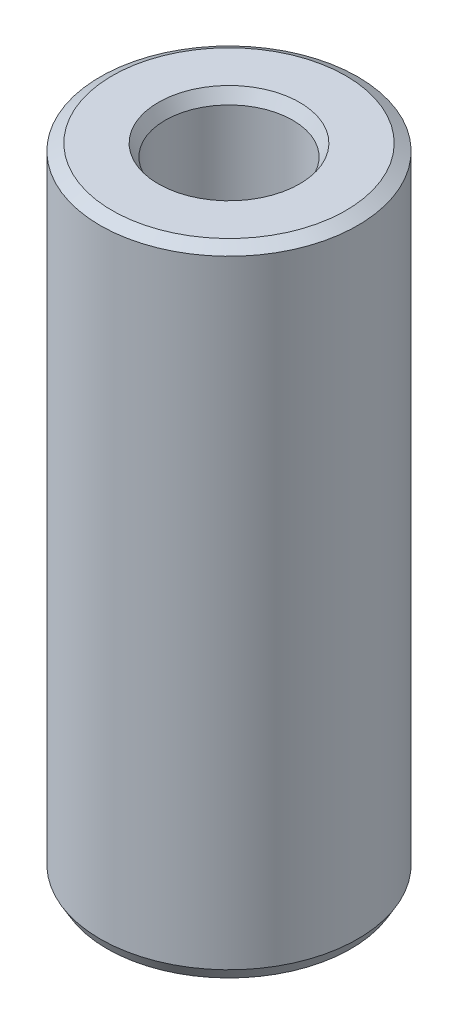
ISO-10303-21;
HEADER;
FILE_DESCRIPTION(('STEP AP214'),'2;1');
FILE_NAME('part.step','',(''),(''),'','','');
FILE_SCHEMA(('AUTOMOTIVE_DESIGN { 1 0 10303 214 1 1 1 1 }'));
ENDSEC;
DATA;
#1=APPLICATION_CONTEXT('core data for automotive mechanical design processes');
#2=APPLICATION_PROTOCOL_DEFINITION('international standard','automotive_design',2000,#1);
#3=PRODUCT_CONTEXT('',#1,'mechanical');
#4=PRODUCT('Part','Part','',(#3));
#5=PRODUCT_RELATED_PRODUCT_CATEGORY('part','',(#4));
#6=PRODUCT_DEFINITION_FORMATION('','',#4);
#7=PRODUCT_DEFINITION_CONTEXT('part definition',#1,'design');
#8=PRODUCT_DEFINITION('design','',#6,#7);
#9=PRODUCT_DEFINITION_SHAPE('','',#8);
#10=(LENGTH_UNIT() NAMED_UNIT(*) SI_UNIT(.MILLI.,.METRE.));
#11=(NAMED_UNIT(*) PLANE_ANGLE_UNIT() SI_UNIT($,.RADIAN.));
#12=(NAMED_UNIT(*) SI_UNIT($,.STERADIAN.) SOLID_ANGLE_UNIT());
#13=UNCERTAINTY_MEASURE_WITH_UNIT(LENGTH_MEASURE(1.E-05),#10,'distance_accuracy_value','');
#14=(GEOMETRIC_REPRESENTATION_CONTEXT(3) GLOBAL_UNCERTAINTY_ASSIGNED_CONTEXT((#13)) GLOBAL_UNIT_ASSIGNED_CONTEXT((#10,
#11,#12)) REPRESENTATION_CONTEXT('',''));
#15=CARTESIAN_POINT('',(0.,0.,0.));
#16=DIRECTION('',(0.,0.,1.));
#17=DIRECTION('',(1.,0.,0.));
#18=AXIS2_PLACEMENT_3D('',#15,#16,#17);
#19=CARTESIAN_POINT('',(0.,135.97263248255,0.));
#20=DIRECTION('',(0.,-1.,0.));
#21=DIRECTION('',(0.,0.,-1.));
#22=AXIS2_PLACEMENT_3D('',#19,#20,#21);
#23=CYLINDRICAL_SURFACE('',#22,27.5);
#24=CARTESIAN_POINT('',(0.,2.55862509389967,0.));
#25=DIRECTION('',(0.,1.,0.));
#26=DIRECTION('',(0.,0.,1.));
#27=AXIS2_PLACEMENT_3D('',#24,#25,#26);
#28=CIRCLE('',#27,27.5);
#29=CARTESIAN_POINT('',(0.,2.55862509389967,27.5));
#30=VERTEX_POINT('',#29);
#31=EDGE_CURVE('E10',#30,#30,#28,.T.);
#32=ORIENTED_EDGE('',*,*,#31,.T.);
#33=EDGE_LOOP('',(#32));
#34=FACE_BOUND('',#33,.T.);
#35=CARTESIAN_POINT('',(0.,134.495409595831,0.));
#36=DIRECTION('',(0.,1.,0.));
#37=DIRECTION('',(0.,0.,1.));
#38=AXIS2_PLACEMENT_3D('',#35,#36,#37);
#39=CIRCLE('',#38,27.5);
#40=CARTESIAN_POINT('',(0.,134.495409595831,-27.5));
#41=VERTEX_POINT('',#40);
#42=EDGE_CURVE('E50',#41,#41,#39,.F.);
#43=ORIENTED_EDGE('',*,*,#42,.T.);
#44=EDGE_LOOP('',(#43));
#45=FACE_BOUND('',#44,.T.);
#46=ADVANCED_FACE('F39',(#34,#45),#23,.T.);
#47=CARTESIAN_POINT('',(0.,135.97263248255,0.));
#48=DIRECTION('',(0.,1.,0.));
#49=DIRECTION('',(0.,0.,1.));
#50=AXIS2_PLACEMENT_3D('',#47,#48,#49);
#51=PLANE('',#50);
#52=CARTESIAN_POINT('',(0.,135.97263248255,0.));
#53=DIRECTION('',(0.,1.,0.));
#54=DIRECTION('',(0.,0.,1.));
#55=AXIS2_PLACEMENT_3D('',#52,#53,#54);
#56=CIRCLE('',#55,15.0886060440407);
#57=CARTESIAN_POINT('',(0.,135.97263248255,15.0886060440407));
#58=VERTEX_POINT('',#57);
#59=EDGE_CURVE('E58',#58,#58,#56,.F.);
#60=ORIENTED_EDGE('',*,*,#59,.T.);
#61=EDGE_LOOP('',(#60));
#62=FACE_BOUND('',#61,.T.);
#63=CARTESIAN_POINT('',(0.,135.97263248255,0.));
#64=DIRECTION('',(0.,1.,0.));
#65=DIRECTION('',(0.,0.,1.));
#66=AXIS2_PLACEMENT_3D('',#63,#64,#65);
#67=CIRCLE('',#66,24.9413749061004);
#68=CARTESIAN_POINT('',(0.,135.97263248255,-24.9413749061004));
#69=VERTEX_POINT('',#68);
#70=EDGE_CURVE('E61',#69,#69,#67,.T.);
#71=ORIENTED_EDGE('',*,*,#70,.T.);
#72=EDGE_LOOP('',(#71));
#73=FACE_BOUND('',#72,.T.);
#74=ADVANCED_FACE('F88',(#62,#73),#51,.T.);
#75=CARTESIAN_POINT('',(0.,0.,0.));
#76=DIRECTION('',(0.,1.,0.));
#77=DIRECTION('',(0.,0.,1.));
#78=AXIS2_PLACEMENT_3D('',#75,#76,#77);
#79=PLANE('',#78);
#80=CARTESIAN_POINT('',(0.,0.,0.));
#81=DIRECTION('',(0.,1.,0.));
#82=DIRECTION('',(0.,0.,1.));
#83=AXIS2_PLACEMENT_3D('',#80,#81,#82);
#84=CIRCLE('',#83,16.170008251222);
#85=CARTESIAN_POINT('',(0.,0.,-16.170008251222));
#86=VERTEX_POINT('',#85);
#87=EDGE_CURVE('E51',#86,#86,#84,.T.);
#88=ORIENTED_EDGE('',*,*,#87,.T.);
#89=EDGE_LOOP('',(#88));
#90=FACE_BOUND('',#89,.T.);
#91=CARTESIAN_POINT('',(0.,0.,0.));
#92=DIRECTION('',(0.,1.,0.));
#93=DIRECTION('',(0.,0.,1.));
#94=AXIS2_PLACEMENT_3D('',#91,#92,#93);
#95=CIRCLE('',#94,26.0227771132817);
#96=CARTESIAN_POINT('',(0.,0.,26.0227771132817));
#97=VERTEX_POINT('',#96);
#98=EDGE_CURVE('E54',#97,#97,#95,.F.);
#99=ORIENTED_EDGE('',*,*,#98,.T.);
#100=EDGE_LOOP('',(#99));
#101=FACE_BOUND('',#100,.T.);
#102=ADVANCED_FACE('F83',(#90,#101),#79,.F.);
#103=CARTESIAN_POINT('',(0.,135.97263248255,0.));
#104=DIRECTION('',(0.,-1.,0.));
#105=DIRECTION('',(0.,0.,-1.));
#106=AXIS2_PLACEMENT_3D('',#103,#104,#105);
#107=CYLINDRICAL_SURFACE('',#106,13.6113831573224);
#108=CARTESIAN_POINT('',(0.,133.41400738865,0.));
#109=DIRECTION('',(0.,1.,0.));
#110=DIRECTION('',(0.,0.,1.));
#111=AXIS2_PLACEMENT_3D('',#108,#109,#110);
#112=CIRCLE('',#111,13.6113831573224);
#113=CARTESIAN_POINT('',(0.,133.41400738865,13.6113831573224));
#114=VERTEX_POINT('',#113);
#115=EDGE_CURVE('E67',#114,#114,#112,.T.);
#116=ORIENTED_EDGE('',*,*,#115,.T.);
#117=EDGE_LOOP('',(#116));
#118=FACE_BOUND('',#117,.T.);
#119=CARTESIAN_POINT('',(0.,1.47722288671828,0.));
#120=DIRECTION('',(0.,1.,0.));
#121=DIRECTION('',(0.,0.,1.));
#122=AXIS2_PLACEMENT_3D('',#119,#120,#121);
#123=CIRCLE('',#122,13.6113831573224);
#124=CARTESIAN_POINT('',(0.,1.47722288671828,-13.6113831573224));
#125=VERTEX_POINT('',#124);
#126=EDGE_CURVE('E69',#125,#125,#123,.F.);
#127=ORIENTED_EDGE('',*,*,#126,.T.);
#128=EDGE_LOOP('',(#127));
#129=FACE_BOUND('',#128,.T.);
#130=ADVANCED_FACE('F71',(#118,#129),#107,.F.);
#131=CARTESIAN_POINT('',(0.,133.41400738865,0.));
#132=DIRECTION('',(0.,1.,0.));
#133=DIRECTION('',(0.,0.,1.));
#134=AXIS2_PLACEMENT_3D('',#131,#132,#133);
#135=CONICAL_SURFACE('',#134,13.6113831573224,0.523598775598301);
#136=ORIENTED_EDGE('',*,*,#59,.F.);
#137=EDGE_LOOP('',(#136));
#138=FACE_BOUND('',#137,.T.);
#139=ORIENTED_EDGE('',*,*,#115,.F.);
#140=EDGE_LOOP('',(#139));
#141=FACE_BOUND('',#140,.T.);
#142=ADVANCED_FACE('F77',(#138,#141),#135,.F.);
#143=CARTESIAN_POINT('',(0.,0.,0.));
#144=DIRECTION('',(0.,-1.,0.));
#145=DIRECTION('',(0.,0.,-1.));
#146=AXIS2_PLACEMENT_3D('',#143,#144,#145);
#147=CONICAL_SURFACE('',#146,16.170008251222,1.04719755119659);
#148=CARTESIAN_POINT('',(0.,1.47722288671828,-13.6113831573224));
#149=CARTESIAN_POINT('',(0.,1.46183514831497,-13.6380355020505));
#150=CARTESIAN_POINT('',(0.,1.44644740991165,-13.6646878467787));
#151=CARTESIAN_POINT('',(0.,1.41567193310502,-13.7179925362349));
#152=CARTESIAN_POINT('',(0.,1.4002841947017,-13.744644880963));
#153=CARTESIAN_POINT('',(0.,1.36950871789507,-13.7979495704193));
#154=CARTESIAN_POINT('',(0.,1.35412097949176,-13.8246019151474));
#155=CARTESIAN_POINT('',(0.,1.32334550268513,-13.8779066046036));
#156=CARTESIAN_POINT('',(0.,1.30795776428181,-13.9045589493318));
#157=CARTESIAN_POINT('',(0.,1.27718228747518,-13.957863638788));
#158=CARTESIAN_POINT('',(0.,1.26179454907187,-13.9845159835161));
#159=CARTESIAN_POINT('',(0.,1.23101907226524,-14.0378206729724));
#160=CARTESIAN_POINT('',(0.,1.21563133386192,-14.0644730177005));
#161=CARTESIAN_POINT('',(0.,1.18485585705529,-14.1177777071567));
#162=CARTESIAN_POINT('',(0.,1.16946811865197,-14.1444300518848));
#163=CARTESIAN_POINT('',(0.,1.13869264184534,-14.1977347413411));
#164=CARTESIAN_POINT('',(0.,1.12330490344203,-14.2243870860692));
#165=CARTESIAN_POINT('',(0.,1.0925294266354,-14.2776917755254));
#166=CARTESIAN_POINT('',(0.,1.07714168823208,-14.3043441202536));
#167=CARTESIAN_POINT('',(0.,1.04636621142545,-14.3576488097098));
#168=CARTESIAN_POINT('',(0.,1.03097847302213,-14.3843011544379));
#169=CARTESIAN_POINT('',(0.,1.0002029962155,-14.4376058438942));
#170=CARTESIAN_POINT('',(0.,0.984815257812188,-14.4642581886223));
#171=CARTESIAN_POINT('',(0.,0.954039781005558,-14.5175628780785));
#172=CARTESIAN_POINT('',(0.,0.938652042602242,-14.5442152228067));
#173=CARTESIAN_POINT('',(0.,0.907876565795611,-14.5975199122629));
#174=CARTESIAN_POINT('',(0.,0.892488827392295,-14.624172256991));
#175=CARTESIAN_POINT('',(0.,0.861713350585665,-14.6774769464473));
#176=CARTESIAN_POINT('',(0.,0.846325612182349,-14.7041292911754));
#177=CARTESIAN_POINT('',(0.,0.815550135375718,-14.7574339806316));
#178=CARTESIAN_POINT('',(0.,0.800162396972403,-14.7840863253597));
#179=CARTESIAN_POINT('',(0.,0.769386920165772,-14.837391014816));
#180=CARTESIAN_POINT('',(0.,0.753999181762457,-14.8640433595441));
#181=CARTESIAN_POINT('',(0.,0.723223704955826,-14.9173480490003));
#182=CARTESIAN_POINT('',(0.,0.70783596655251,-14.9440003937285));
#183=CARTESIAN_POINT('',(0.,0.677060489745879,-14.9973050831847));
#184=CARTESIAN_POINT('',(0.,0.661672751342564,-15.0239574279128));
#185=CARTESIAN_POINT('',(0.,0.630897274535933,-15.0772621173691));
#186=CARTESIAN_POINT('',(0.,0.615509536132618,-15.1039144620972));
#187=CARTESIAN_POINT('',(0.,0.584734059325987,-15.1572191515534));
#188=CARTESIAN_POINT('',(0.,0.569346320922671,-15.1838714962816));
#189=CARTESIAN_POINT('',(0.,0.53857084411604,-15.2371761857378));
#190=CARTESIAN_POINT('',(0.,0.523183105712725,-15.2638285304659));
#191=CARTESIAN_POINT('',(0.,0.492407628906094,-15.3171332199222));
#192=CARTESIAN_POINT('',(0.,0.477019890502779,-15.3437855646503));
#193=CARTESIAN_POINT('',(0.,0.446244413696148,-15.3970902541065));
#194=CARTESIAN_POINT('',(0.,0.430856675292832,-15.4237425988346));
#195=CARTESIAN_POINT('',(0.,0.400081198486201,-15.4770472882909));
#196=CARTESIAN_POINT('',(0.,0.384693460082886,-15.503699633019));
#197=CARTESIAN_POINT('',(0.,0.353917983276255,-15.5570043224752));
#198=CARTESIAN_POINT('',(0.,0.33853024487294,-15.5836566672034));
#199=CARTESIAN_POINT('',(0.,0.307754768066309,-15.6369613566596));
#200=CARTESIAN_POINT('',(0.,0.292367029662993,-15.6636137013877));
#201=CARTESIAN_POINT('',(0.,0.261591552856362,-15.716918390844));
#202=CARTESIAN_POINT('',(0.,0.246203814453047,-15.7435707355721));
#203=CARTESIAN_POINT('',(0.,0.215428337646416,-15.7968754250283));
#204=CARTESIAN_POINT('',(0.,0.200040599243101,-15.8235277697565));
#205=CARTESIAN_POINT('',(0.,0.16926512243647,-15.8768324592127));
#206=CARTESIAN_POINT('',(0.,0.153877384033154,-15.9034848039408));
#207=CARTESIAN_POINT('',(0.,0.123101907226523,-15.9567894933971));
#208=CARTESIAN_POINT('',(0.,0.107714168823208,-15.9834418381252));
#209=CARTESIAN_POINT('',(0.,0.0769386920165772,-16.0367465275814));
#210=CARTESIAN_POINT('',(0.,0.0615509536132618,-16.0633988723095));
#211=CARTESIAN_POINT('',(0.,0.0307754768066309,-16.1167035617658));
#212=CARTESIAN_POINT('',(0.,0.0153877384033154,-16.1433559064939));
#213=CARTESIAN_POINT('',(0.,0.,-16.170008251222));
#214=B_SPLINE_CURVE_WITH_KNOTS('',3,(#148,#149,#150,#151,#152,#153,#154,#155,#156,#157,#158,
#159,#160,#161,#162,#163,#164,#165,#166,#167,#168,#169,#170,#171,#172,#173,#174,#175,#176,#177,
#178,#179,#180,#181,#182,#183,#184,#185,#186,#187,#188,#189,#190,#191,#192,#193,#194,#195,#196,
#197,#198,#199,#200,#201,#202,#203,#204,#205,#206,#207,#208,#209,#210,#211,#212,#213),
.UNSPECIFIED.,.F.,.F.,(4,2,2,2,2,2,2,2,2,2,2,2,2,2,2,2,2,2,2,2,2,2,2,2,2,2,2,2,2,2,2,2,4),(0.,
0.0923264304198916,0.184652860839783,0.276979291259676,0.369305721679568,0.46163215209946,
0.553958582519353,0.646285012939245,0.738611443359136,0.830937873779028,0.92326430419892,
1.01559073461881,1.1079171650387,1.2002435954586,1.29257002587849,1.38489645629838,
1.47722288671827,1.56954931713816,1.66187574755806,1.75420217797795,1.84652860839784,
1.93885503881773,2.03118146923762,2.12350789965752,2.21583433007741,2.3081607604973,
2.40048719091719,2.49281362133708,2.58514005175698,2.67746648217687,2.76979291259676,
2.86211934301665,2.95444577343655),.UNSPECIFIED.);
#215=EDGE_CURVE('BSEAM73',#125,#86,#214,.T.);
#216=ORIENTED_EDGE('',*,*,#126,.F.);
#217=ORIENTED_EDGE('',*,*,#87,.F.);
#218=ORIENTED_EDGE('',*,*,#215,.T.);
#219=ORIENTED_EDGE('',*,*,#215,.F.);
#220=EDGE_LOOP('',(#216,#218,#217,#219));
#221=FACE_BOUND('',#220,.T.);
#222=ADVANCED_FACE('F73',(#221),#147,.F.);
#223=CARTESIAN_POINT('',(0.,2.55862509389967,0.));
#224=DIRECTION('',(0.,1.,0.));
#225=DIRECTION('',(0.,0.,1.));
#226=AXIS2_PLACEMENT_3D('',#223,#224,#225);
#227=CONICAL_SURFACE('',#226,27.5,0.523598775598302);
#228=ORIENTED_EDGE('',*,*,#98,.F.);
#229=EDGE_LOOP('',(#228));
#230=FACE_BOUND('',#229,.T.);
#231=ORIENTED_EDGE('',*,*,#31,.F.);
#232=EDGE_LOOP('',(#231));
#233=FACE_BOUND('',#232,.T.);
#234=ADVANCED_FACE('F76',(#230,#233),#227,.T.);
#235=CARTESIAN_POINT('',(0.,135.97263248255,0.));
#236=DIRECTION('',(0.,-1.,0.));
#237=DIRECTION('',(0.,0.,-1.));
#238=AXIS2_PLACEMENT_3D('',#235,#236,#237);
#239=CONICAL_SURFACE('',#238,24.9413749061004,1.0471975511966);
#240=CARTESIAN_POINT('',(0.,134.495409595831,-27.5));
#241=CARTESIAN_POINT('',(0.,134.510797334235,-27.4733476552719));
#242=CARTESIAN_POINT('',(0.,134.526185072638,-27.4466953105438));
#243=CARTESIAN_POINT('',(0.,134.556960549445,-27.3933906210875));
#244=CARTESIAN_POINT('',(0.,134.572348287848,-27.3667382763594));
#245=CARTESIAN_POINT('',(0.,134.603123764655,-27.3134335869032));
#246=CARTESIAN_POINT('',(0.,134.618511503058,-27.2867812421751));
#247=CARTESIAN_POINT('',(0.,134.649286979865,-27.2334765527188));
#248=CARTESIAN_POINT('',(0.,134.664674718268,-27.2068242079907));
#249=CARTESIAN_POINT('',(0.,134.695450195074,-27.1535195185344));
#250=CARTESIAN_POINT('',(0.,134.710837933478,-27.1268671738063));
#251=CARTESIAN_POINT('',(0.,134.741613410284,-27.0735624843501));
#252=CARTESIAN_POINT('',(0.,134.757001148688,-27.046910139622));
#253=CARTESIAN_POINT('',(0.,134.787776625494,-26.9936054501657));
#254=CARTESIAN_POINT('',(0.,134.803164363898,-26.9669531054376));
#255=CARTESIAN_POINT('',(0.,134.833939840704,-26.9136484159814));
#256=CARTESIAN_POINT('',(0.,134.849327579108,-26.8869960712532));
#257=CARTESIAN_POINT('',(0.,134.880103055914,-26.833691381797));
#258=CARTESIAN_POINT('',(0.,134.895490794318,-26.8070390370689));
#259=CARTESIAN_POINT('',(0.,134.926266271124,-26.7537343476126));
#260=CARTESIAN_POINT('',(0.,134.941654009528,-26.7270820028845));
#261=CARTESIAN_POINT('',(0.,134.972429486334,-26.6737773134283));
#262=CARTESIAN_POINT('',(0.,134.987817224737,-26.6471249687001));
#263=CARTESIAN_POINT('',(0.,135.018592701544,-26.5938202792439));
#264=CARTESIAN_POINT('',(0.,135.033980439947,-26.5671679345158));
#265=CARTESIAN_POINT('',(0.,135.064755916754,-26.5138632450595));
#266=CARTESIAN_POINT('',(0.,135.080143655157,-26.4872109003314));
#267=CARTESIAN_POINT('',(0.,135.110919131964,-26.4339062108752));
#268=CARTESIAN_POINT('',(0.,135.126306870367,-26.407253866147));
#269=CARTESIAN_POINT('',(0.,135.157082347174,-26.3539491766908));
#270=CARTESIAN_POINT('',(0.,135.172470085577,-26.3272968319627));
#271=CARTESIAN_POINT('',(0.,135.203245562384,-26.2739921425064));
#272=CARTESIAN_POINT('',(0.,135.218633300787,-26.2473397977783));
#273=CARTESIAN_POINT('',(0.,135.249408777594,-26.1940351083221));
#274=CARTESIAN_POINT('',(0.,135.264796515997,-26.167382763594));
#275=CARTESIAN_POINT('',(0.,135.295571992804,-26.1140780741377));
#276=CARTESIAN_POINT('',(0.,135.310959731207,-26.0874257294096));
#277=CARTESIAN_POINT('',(0.,135.341735208014,-26.0341210399534));
#278=CARTESIAN_POINT('',(0.,135.357122946417,-26.0074686952252));
#279=CARTESIAN_POINT('',(0.,135.387898423224,-25.954164005769));
#280=CARTESIAN_POINT('',(0.,135.403286161627,-25.9275116610409));
#281=CARTESIAN_POINT('',(0.,135.434061638434,-25.8742069715846));
#282=CARTESIAN_POINT('',(0.,135.449449376837,-25.8475546268565));
#283=CARTESIAN_POINT('',(0.,135.480224853644,-25.7942499374003));
#284=CARTESIAN_POINT('',(0.,135.495612592047,-25.7675975926721));
#285=CARTESIAN_POINT('',(0.,135.526388068854,-25.7142929032159));
#286=CARTESIAN_POINT('',(0.,135.541775807257,-25.6876405584878));
#287=CARTESIAN_POINT('',(0.,135.572551284063,-25.6343358690315));
#288=CARTESIAN_POINT('',(0.,135.587939022467,-25.6076835243034));
#289=CARTESIAN_POINT('',(0.,135.618714499273,-25.5543788348472));
#290=CARTESIAN_POINT('',(0.,135.634102237677,-25.527726490119));
#291=CARTESIAN_POINT('',(0.,135.664877714483,-25.4744218006628));
#292=CARTESIAN_POINT('',(0.,135.680265452887,-25.4477694559347));
#293=CARTESIAN_POINT('',(0.,135.711040929693,-25.3944647664784));
#294=CARTESIAN_POINT('',(0.,135.726428668097,-25.3678124217503));
#295=CARTESIAN_POINT('',(0.,135.757204144903,-25.3145077322941));
#296=CARTESIAN_POINT('',(0.,135.772591883307,-25.287855387566));
#297=CARTESIAN_POINT('',(0.,135.803367360113,-25.2345506981097));
#298=CARTESIAN_POINT('',(0.,135.818755098517,-25.2078983533816));
#299=CARTESIAN_POINT('',(0.,135.849530575323,-25.1545936639253));
#300=CARTESIAN_POINT('',(0.,135.864918313726,-25.1279413191972));
#301=CARTESIAN_POINT('',(0.,135.895693790533,-25.074636629741));
#302=CARTESIAN_POINT('',(0.,135.911081528936,-25.0479842850129));
#303=CARTESIAN_POINT('',(0.,135.941857005743,-24.9946795955566));
#304=CARTESIAN_POINT('',(0.,135.957244744146,-24.9680272508285));
#305=CARTESIAN_POINT('',(0.,135.97263248255,-24.9413749061004));
#306=B_SPLINE_CURVE_WITH_KNOTS('',3,(#240,#241,#242,#243,#244,#245,#246,#247,#248,#249,#250,
#251,#252,#253,#254,#255,#256,#257,#258,#259,#260,#261,#262,#263,#264,#265,#266,#267,#268,#269,
#270,#271,#272,#273,#274,#275,#276,#277,#278,#279,#280,#281,#282,#283,#284,#285,#286,#287,#288,
#289,#290,#291,#292,#293,#294,#295,#296,#297,#298,#299,#300,#301,#302,#303,#304,#305),
.UNSPECIFIED.,.F.,.F.,(4,2,2,2,2,2,2,2,2,2,2,2,2,2,2,2,2,2,2,2,2,2,2,2,2,2,2,2,2,2,2,2,4),(0.,
0.092326430419879,0.184652860839775,0.276979291259671,0.369305721679564,0.461632152099457,
0.553958582519353,0.646285012939249,0.738611443359142,0.830937873779037,0.92326430419893,
1.01559073461881,1.10791716503871,1.2002435954586,1.29257002587849,1.38489645629839,
1.47722288671828,1.56954931713818,1.66187574755807,1.75420217797797,1.84652860839786,
1.93885503881776,2.03118146923764,2.12350789965753,2.21583433007742,2.30816076049732,
2.40048719091721,2.49281362133711,2.585140051757,2.6774664821769,2.76979291259679,
2.86211934301669,2.95444577343658),.UNSPECIFIED.);
#307=EDGE_CURVE('BSEAM45',#41,#69,#306,.T.);
#308=ORIENTED_EDGE('',*,*,#42,.F.);
#309=ORIENTED_EDGE('',*,*,#70,.F.);
#310=ORIENTED_EDGE('',*,*,#307,.T.);
#311=ORIENTED_EDGE('',*,*,#307,.F.);
#312=EDGE_LOOP('',(#308,#310,#309,#311));
#313=FACE_BOUND('',#312,.T.);
#314=ADVANCED_FACE('F45',(#313),#239,.T.);
#315=CLOSED_SHELL('',(#46,#74,#102,#130,#142,#222,#234,#314));
#316=MANIFOLD_SOLID_BREP('B2',#315);
#317=ADVANCED_BREP_SHAPE_REPRESENTATION('',(#18,#316),#14);
#318=SHAPE_DEFINITION_REPRESENTATION(#9,#317);
ENDSEC;
END-ISO-10303-21;
